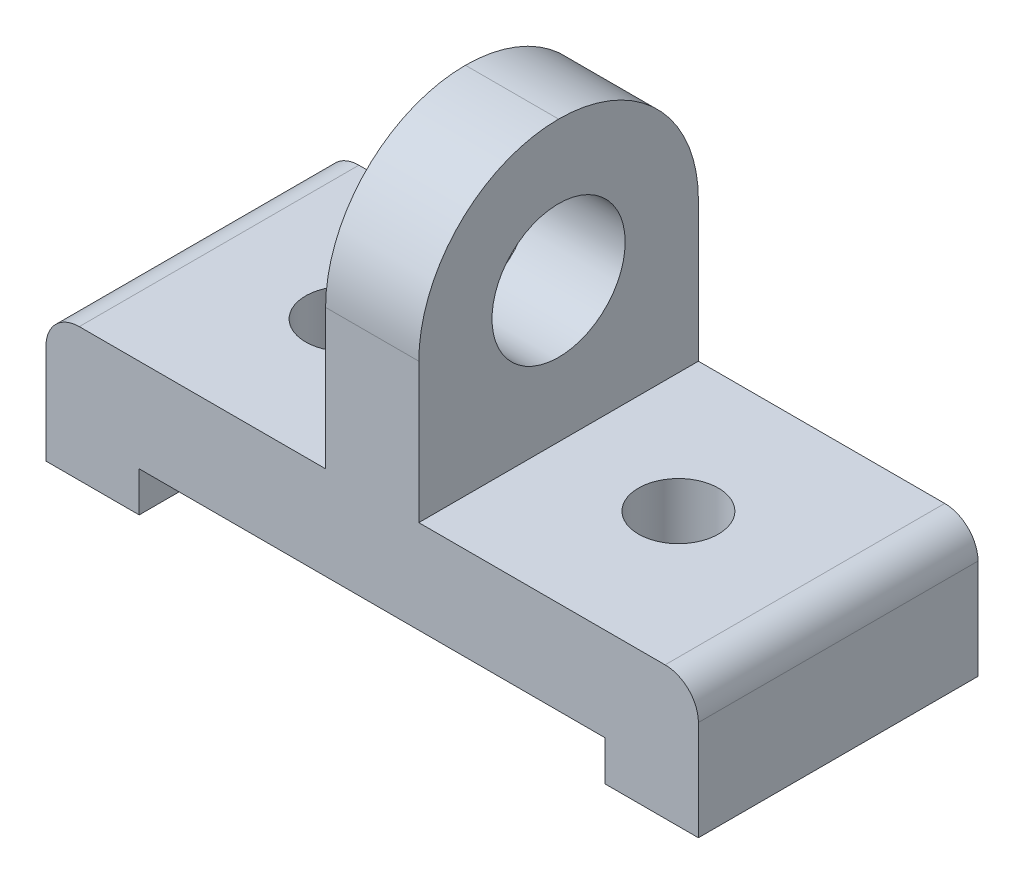
ISO-10303-21;
HEADER;
FILE_DESCRIPTION(('STEP AP214'),'2;1');
FILE_NAME('part.step','',(''),(''),'','','');
FILE_SCHEMA(('AUTOMOTIVE_DESIGN { 1 0 10303 214 1 1 1 1 }'));
ENDSEC;
DATA;
#1=APPLICATION_CONTEXT('core data for automotive mechanical design processes');
#2=APPLICATION_PROTOCOL_DEFINITION('international standard','automotive_design',2000,#1);
#3=PRODUCT_CONTEXT('',#1,'mechanical');
#4=PRODUCT('Part','Part','',(#3));
#5=PRODUCT_RELATED_PRODUCT_CATEGORY('part','',(#4));
#6=PRODUCT_DEFINITION_FORMATION('','',#4);
#7=PRODUCT_DEFINITION_CONTEXT('part definition',#1,'design');
#8=PRODUCT_DEFINITION('design','',#6,#7);
#9=PRODUCT_DEFINITION_SHAPE('','',#8);
#10=(LENGTH_UNIT() NAMED_UNIT(*) SI_UNIT(.MILLI.,.METRE.));
#11=(NAMED_UNIT(*) PLANE_ANGLE_UNIT() SI_UNIT($,.RADIAN.));
#12=(NAMED_UNIT(*) SI_UNIT($,.STERADIAN.) SOLID_ANGLE_UNIT());
#13=UNCERTAINTY_MEASURE_WITH_UNIT(LENGTH_MEASURE(1.E-05),#10,'distance_accuracy_value','');
#14=(GEOMETRIC_REPRESENTATION_CONTEXT(3) GLOBAL_UNCERTAINTY_ASSIGNED_CONTEXT((#13)) GLOBAL_UNIT_ASSIGNED_CONTEXT((#10,
#11,#12)) REPRESENTATION_CONTEXT('',''));
#15=CARTESIAN_POINT('',(0.,0.,0.));
#16=DIRECTION('',(0.,0.,1.));
#17=DIRECTION('',(1.,0.,0.));
#18=AXIS2_PLACEMENT_3D('',#15,#16,#17);
#19=CARTESIAN_POINT('',(-14.,20.,-42.));
#20=DIRECTION('',(0.,1.,0.));
#21=DIRECTION('',(0.,0.,1.));
#22=AXIS2_PLACEMENT_3D('',#19,#20,#21);
#23=PLANE('',#22);
#24=DIRECTION('',(-1.,0.,0.));
#25=VECTOR('',#24,1.);
#26=CARTESIAN_POINT('',(-14.,20.,-42.));
#27=LINE('',#26,#25);
#28=CARTESIAN_POINT('',(28.,20.,-42.));
#29=VERTEX_POINT('',#28);
#30=CARTESIAN_POINT('',(-9.,20.,-42.));
#31=VERTEX_POINT('',#30);
#32=EDGE_CURVE('E153',#29,#31,#27,.T.);
#33=ORIENTED_EDGE('',*,*,#32,.T.);
#34=DIRECTION('',(0.,0.,1.));
#35=VECTOR('',#34,1.);
#36=CARTESIAN_POINT('',(-9.,20.,-42.));
#37=LINE('',#36,#35);
#38=CARTESIAN_POINT('',(-9.,20.,0.));
#39=VERTEX_POINT('',#38);
#40=EDGE_CURVE('E295',#31,#39,#37,.T.);
#41=ORIENTED_EDGE('',*,*,#40,.T.);
#42=DIRECTION('',(-1.,0.,0.));
#43=VECTOR('',#42,1.);
#44=CARTESIAN_POINT('',(-14.,20.,0.));
#45=LINE('',#44,#43);
#46=CARTESIAN_POINT('',(28.,20.,0.));
#47=VERTEX_POINT('',#46);
#48=EDGE_CURVE('E244',#47,#39,#45,.T.);
#49=ORIENTED_EDGE('',*,*,#48,.F.);
#50=DIRECTION('',(0.,0.,1.));
#51=VECTOR('',#50,1.);
#52=CARTESIAN_POINT('',(28.,20.,-42.));
#53=LINE('',#52,#51);
#54=EDGE_CURVE('E172',#29,#47,#53,.T.);
#55=ORIENTED_EDGE('',*,*,#54,.F.);
#56=EDGE_LOOP('',(#33,#41,#49,#55));
#57=FACE_BOUND('',#56,.T.);
#58=CARTESIAN_POINT('',(10.,20.,-21.));
#59=DIRECTION('',(0.,1.,0.));
#60=DIRECTION('',(0.,0.,-1.));
#61=AXIS2_PLACEMENT_3D('',#58,#59,#60);
#62=CIRCLE('',#61,6.);
#63=CARTESIAN_POINT('',(10.,20.,-15.));
#64=VERTEX_POINT('',#63);
#65=EDGE_CURVE('E187',#64,#64,#62,.T.);
#66=ORIENTED_EDGE('',*,*,#65,.F.);
#67=EDGE_LOOP('',(#66));
#68=FACE_BOUND('',#67,.T.);
#69=ADVANCED_FACE('F39',(#57,#68),#23,.T.);
#70=CARTESIAN_POINT('',(0.,6.,-42.));
#71=DIRECTION('',(1.,0.,0.));
#72=DIRECTION('',(0.,1.,0.));
#73=AXIS2_PLACEMENT_3D('',#70,#71,#72);
#74=PLANE('',#73);
#75=DIRECTION('',(0.,1.,0.));
#76=VECTOR('',#75,1.);
#77=CARTESIAN_POINT('',(0.,6.,0.));
#78=LINE('',#77,#76);
#79=CARTESIAN_POINT('',(0.,0.,0.));
#80=VERTEX_POINT('',#79);
#81=CARTESIAN_POINT('',(0.,6.,0.));
#82=VERTEX_POINT('',#81);
#83=EDGE_CURVE('E223',#80,#82,#78,.T.);
#84=ORIENTED_EDGE('',*,*,#83,.F.);
#85=DIRECTION('',(0.,0.,1.));
#86=VECTOR('',#85,1.);
#87=CARTESIAN_POINT('',(0.,0.,-42.));
#88=LINE('',#87,#86);
#89=CARTESIAN_POINT('',(0.,0.,-42.));
#90=VERTEX_POINT('',#89);
#91=EDGE_CURVE('E254',#90,#80,#88,.T.);
#92=ORIENTED_EDGE('',*,*,#91,.F.);
#93=DIRECTION('',(0.,1.,0.));
#94=VECTOR('',#93,1.);
#95=CARTESIAN_POINT('',(0.,6.,-42.));
#96=LINE('',#95,#94);
#97=CARTESIAN_POINT('',(0.,6.,-42.));
#98=VERTEX_POINT('',#97);
#99=EDGE_CURVE('E196',#90,#98,#96,.T.);
#100=ORIENTED_EDGE('',*,*,#99,.T.);
#101=DIRECTION('',(0.,0.,1.));
#102=VECTOR('',#101,1.);
#103=CARTESIAN_POINT('',(0.,6.,-42.));
#104=LINE('',#103,#102);
#105=EDGE_CURVE('E222',#98,#82,#104,.T.);
#106=ORIENTED_EDGE('',*,*,#105,.T.);
#107=EDGE_LOOP('',(#84,#92,#100,#106));
#108=FACE_BOUND('',#107,.T.);
#109=ADVANCED_FACE('F342',(#108),#74,.T.);
#110=CARTESIAN_POINT('',(0.,0.,-42.));
#111=DIRECTION('',(0.,-1.,0.));
#112=DIRECTION('',(1.,0.,0.));
#113=AXIS2_PLACEMENT_3D('',#110,#111,#112);
#114=PLANE('',#113);
#115=DIRECTION('',(1.,0.,0.));
#116=VECTOR('',#115,1.);
#117=CARTESIAN_POINT('',(0.,0.,0.));
#118=LINE('',#117,#116);
#119=CARTESIAN_POINT('',(-14.,0.,0.));
#120=VERTEX_POINT('',#119);
#121=EDGE_CURVE('E201',#120,#80,#118,.T.);
#122=ORIENTED_EDGE('',*,*,#121,.F.);
#123=DIRECTION('',(0.,0.,1.));
#124=VECTOR('',#123,1.);
#125=CARTESIAN_POINT('',(-14.,0.,-42.));
#126=LINE('',#125,#124);
#127=CARTESIAN_POINT('',(-14.,0.,-42.));
#128=VERTEX_POINT('',#127);
#129=EDGE_CURVE('E258',#128,#120,#126,.T.);
#130=ORIENTED_EDGE('',*,*,#129,.F.);
#131=DIRECTION('',(1.,0.,0.));
#132=VECTOR('',#131,1.);
#133=CARTESIAN_POINT('',(0.,0.,-42.));
#134=LINE('',#133,#132);
#135=EDGE_CURVE('E218',#128,#90,#134,.T.);
#136=ORIENTED_EDGE('',*,*,#135,.T.);
#137=ORIENTED_EDGE('',*,*,#91,.T.);
#138=EDGE_LOOP('',(#122,#130,#136,#137));
#139=FACE_BOUND('',#138,.T.);
#140=ADVANCED_FACE('F345',(#139),#114,.T.);
#141=CARTESIAN_POINT('',(-14.,0.,-42.));
#142=DIRECTION('',(-1.,0.,0.));
#143=DIRECTION('',(0.,0.,1.));
#144=AXIS2_PLACEMENT_3D('',#141,#142,#143);
#145=PLANE('',#144);
#146=DIRECTION('',(0.,-1.,0.));
#147=VECTOR('',#146,1.);
#148=CARTESIAN_POINT('',(-14.,0.,0.));
#149=LINE('',#148,#147);
#150=CARTESIAN_POINT('',(-14.,15.,0.));
#151=VERTEX_POINT('',#150);
#152=EDGE_CURVE('E248',#151,#120,#149,.T.);
#153=ORIENTED_EDGE('',*,*,#152,.F.);
#154=DIRECTION('',(0.,0.,1.));
#155=VECTOR('',#154,1.);
#156=CARTESIAN_POINT('',(-14.,15.,-42.));
#157=LINE('',#156,#155);
#158=CARTESIAN_POINT('',(-14.,15.,-42.));
#159=VERTEX_POINT('',#158);
#160=EDGE_CURVE('E309',#151,#159,#157,.F.);
#161=ORIENTED_EDGE('',*,*,#160,.T.);
#162=DIRECTION('',(0.,-1.,0.));
#163=VECTOR('',#162,1.);
#164=CARTESIAN_POINT('',(-14.,0.,-42.));
#165=LINE('',#164,#163);
#166=EDGE_CURVE('E152',#159,#128,#165,.T.);
#167=ORIENTED_EDGE('',*,*,#166,.T.);
#168=ORIENTED_EDGE('',*,*,#129,.T.);
#169=EDGE_LOOP('',(#153,#161,#167,#168));
#170=FACE_BOUND('',#169,.T.);
#171=ADVANCED_FACE('F388',(#170),#145,.T.);
#172=CARTESIAN_POINT('',(79.,20.,0.));
#173=VERTEX_POINT('',#172);
#174=CARTESIAN_POINT('',(42.,20.,0.));
#175=VERTEX_POINT('',#174);
#176=EDGE_CURVE('E245',#173,#175,#45,.T.);
#177=ORIENTED_EDGE('',*,*,#176,.F.);
#178=DIRECTION('',(0.,0.,1.));
#179=VECTOR('',#178,1.);
#180=CARTESIAN_POINT('',(79.,20.,-42.));
#181=LINE('',#180,#179);
#182=CARTESIAN_POINT('',(79.,20.,-42.));
#183=VERTEX_POINT('',#182);
#184=EDGE_CURVE('E11',#173,#183,#181,.F.);
#185=ORIENTED_EDGE('',*,*,#184,.T.);
#186=CARTESIAN_POINT('',(42.,20.,-42.));
#187=VERTEX_POINT('',#186);
#188=EDGE_CURVE('E145',#183,#187,#27,.T.);
#189=ORIENTED_EDGE('',*,*,#188,.T.);
#190=DIRECTION('',(0.,0.,-1.));
#191=VECTOR('',#190,1.);
#192=CARTESIAN_POINT('',(42.,20.,-42.));
#193=LINE('',#192,#191);
#194=EDGE_CURVE('E150',#175,#187,#193,.T.);
#195=ORIENTED_EDGE('',*,*,#194,.F.);
#196=EDGE_LOOP('',(#177,#185,#189,#195));
#197=FACE_BOUND('',#196,.T.);
#198=CARTESIAN_POINT('',(60.,20.,-21.));
#199=DIRECTION('',(0.,1.,0.));
#200=DIRECTION('',(0.,0.,1.));
#201=AXIS2_PLACEMENT_3D('',#198,#199,#200);
#202=CIRCLE('',#201,6.);
#203=CARTESIAN_POINT('',(60.,20.,-15.));
#204=VERTEX_POINT('',#203);
#205=EDGE_CURVE('E188',#204,#204,#202,.T.);
#206=ORIENTED_EDGE('',*,*,#205,.F.);
#207=EDGE_LOOP('',(#206));
#208=FACE_BOUND('',#207,.T.);
#209=ADVANCED_FACE('F147',(#197,#208),#23,.T.);
#210=CARTESIAN_POINT('',(84.,20.,-42.));
#211=DIRECTION('',(1.,0.,0.));
#212=DIRECTION('',(0.,1.,0.));
#213=AXIS2_PLACEMENT_3D('',#210,#211,#212);
#214=PLANE('',#213);
#215=DIRECTION('',(0.,1.,0.));
#216=VECTOR('',#215,1.);
#217=CARTESIAN_POINT('',(84.,20.,-42.));
#218=LINE('',#217,#216);
#219=CARTESIAN_POINT('',(84.,0.,-42.));
#220=VERTEX_POINT('',#219);
#221=CARTESIAN_POINT('',(84.,15.,-42.));
#222=VERTEX_POINT('',#221);
#223=EDGE_CURVE('E213',#220,#222,#218,.T.);
#224=ORIENTED_EDGE('',*,*,#223,.T.);
#225=DIRECTION('',(0.,0.,1.));
#226=VECTOR('',#225,1.);
#227=CARTESIAN_POINT('',(84.,15.,-42.));
#228=LINE('',#227,#226);
#229=CARTESIAN_POINT('',(84.,15.,0.));
#230=VERTEX_POINT('',#229);
#231=EDGE_CURVE('E48',#222,#230,#228,.T.);
#232=ORIENTED_EDGE('',*,*,#231,.T.);
#233=DIRECTION('',(0.,1.,0.));
#234=VECTOR('',#233,1.);
#235=CARTESIAN_POINT('',(84.,20.,0.));
#236=LINE('',#235,#234);
#237=CARTESIAN_POINT('',(84.,0.,0.));
#238=VERTEX_POINT('',#237);
#239=EDGE_CURVE('E240',#238,#230,#236,.T.);
#240=ORIENTED_EDGE('',*,*,#239,.F.);
#241=DIRECTION('',(0.,0.,1.));
#242=VECTOR('',#241,1.);
#243=CARTESIAN_POINT('',(84.,0.,-42.));
#244=LINE('',#243,#242);
#245=EDGE_CURVE('E262',#220,#238,#244,.T.);
#246=ORIENTED_EDGE('',*,*,#245,.F.);
#247=EDGE_LOOP('',(#224,#232,#240,#246));
#248=FACE_BOUND('',#247,.T.);
#249=ADVANCED_FACE('F321',(#248),#214,.T.);
#250=CARTESIAN_POINT('',(84.,0.,-42.));
#251=DIRECTION('',(0.,-1.,0.));
#252=DIRECTION('',(1.,0.,0.));
#253=AXIS2_PLACEMENT_3D('',#250,#251,#252);
#254=PLANE('',#253);
#255=DIRECTION('',(1.,0.,0.));
#256=VECTOR('',#255,1.);
#257=CARTESIAN_POINT('',(84.,0.,0.));
#258=LINE('',#257,#256);
#259=CARTESIAN_POINT('',(70.,0.,0.));
#260=VERTEX_POINT('',#259);
#261=EDGE_CURVE('E236',#260,#238,#258,.T.);
#262=ORIENTED_EDGE('',*,*,#261,.F.);
#263=DIRECTION('',(0.,0.,1.));
#264=VECTOR('',#263,1.);
#265=CARTESIAN_POINT('',(70.,0.,-42.));
#266=LINE('',#265,#264);
#267=CARTESIAN_POINT('',(70.,0.,-42.));
#268=VERTEX_POINT('',#267);
#269=EDGE_CURVE('E265',#268,#260,#266,.T.);
#270=ORIENTED_EDGE('',*,*,#269,.F.);
#271=DIRECTION('',(1.,0.,0.));
#272=VECTOR('',#271,1.);
#273=CARTESIAN_POINT('',(84.,0.,-42.));
#274=LINE('',#273,#272);
#275=EDGE_CURVE('E209',#268,#220,#274,.T.);
#276=ORIENTED_EDGE('',*,*,#275,.T.);
#277=ORIENTED_EDGE('',*,*,#245,.T.);
#278=EDGE_LOOP('',(#262,#270,#276,#277));
#279=FACE_BOUND('',#278,.T.);
#280=ADVANCED_FACE('F329',(#279),#254,.T.);
#281=CARTESIAN_POINT('',(70.,0.,-42.));
#282=DIRECTION('',(-1.,0.,0.));
#283=DIRECTION('',(0.,0.,1.));
#284=AXIS2_PLACEMENT_3D('',#281,#282,#283);
#285=PLANE('',#284);
#286=DIRECTION('',(0.,-1.,0.));
#287=VECTOR('',#286,1.);
#288=CARTESIAN_POINT('',(70.,0.,0.));
#289=LINE('',#288,#287);
#290=CARTESIAN_POINT('',(70.,6.00000000000001,0.));
#291=VERTEX_POINT('',#290);
#292=EDGE_CURVE('E232',#291,#260,#289,.T.);
#293=ORIENTED_EDGE('',*,*,#292,.F.);
#294=DIRECTION('',(0.,0.,1.));
#295=VECTOR('',#294,1.);
#296=CARTESIAN_POINT('',(70.,6.00000000000001,-42.));
#297=LINE('',#296,#295);
#298=CARTESIAN_POINT('',(70.,6.00000000000001,-42.));
#299=VERTEX_POINT('',#298);
#300=EDGE_CURVE('E268',#299,#291,#297,.T.);
#301=ORIENTED_EDGE('',*,*,#300,.F.);
#302=DIRECTION('',(0.,-1.,0.));
#303=VECTOR('',#302,1.);
#304=CARTESIAN_POINT('',(70.,0.,-42.));
#305=LINE('',#304,#303);
#306=EDGE_CURVE('E205',#299,#268,#305,.T.);
#307=ORIENTED_EDGE('',*,*,#306,.T.);
#308=ORIENTED_EDGE('',*,*,#269,.T.);
#309=EDGE_LOOP('',(#293,#301,#307,#308));
#310=FACE_BOUND('',#309,.T.);
#311=ADVANCED_FACE('F334',(#310),#285,.T.);
#312=CARTESIAN_POINT('',(70.,6.00000000000001,-42.));
#313=DIRECTION('',(0.,-1.,0.));
#314=DIRECTION('',(1.,0.,0.));
#315=AXIS2_PLACEMENT_3D('',#312,#313,#314);
#316=PLANE('',#315);
#317=CARTESIAN_POINT('',(60.,6.00000000000001,-21.));
#318=DIRECTION('',(0.,-1.,0.));
#319=DIRECTION('',(1.,0.,0.));
#320=AXIS2_PLACEMENT_3D('',#317,#318,#319);
#321=CIRCLE('',#320,6.);
#322=CARTESIAN_POINT('',(60.,6.00000000000001,-15.));
#323=VERTEX_POINT('',#322);
#324=EDGE_CURVE('E228',#323,#323,#321,.T.);
#325=ORIENTED_EDGE('',*,*,#324,.F.);
#326=EDGE_LOOP('',(#325));
#327=FACE_BOUND('',#326,.T.);
#328=CARTESIAN_POINT('',(10.,6.,-21.));
#329=DIRECTION('',(0.,-1.,0.));
#330=DIRECTION('',(1.,0.,0.));
#331=AXIS2_PLACEMENT_3D('',#328,#329,#330);
#332=CIRCLE('',#331,6.);
#333=CARTESIAN_POINT('',(10.,6.00000000000001,-15.));
#334=VERTEX_POINT('',#333);
#335=EDGE_CURVE('E192',#334,#334,#332,.T.);
#336=ORIENTED_EDGE('',*,*,#335,.F.);
#337=EDGE_LOOP('',(#336));
#338=FACE_BOUND('',#337,.T.);
#339=DIRECTION('',(1.,0.,0.));
#340=VECTOR('',#339,1.);
#341=CARTESIAN_POINT('',(70.,6.00000000000001,0.));
#342=LINE('',#341,#340);
#343=EDGE_CURVE('E227',#82,#291,#342,.T.);
#344=ORIENTED_EDGE('',*,*,#343,.F.);
#345=ORIENTED_EDGE('',*,*,#105,.F.);
#346=DIRECTION('',(1.,0.,0.));
#347=VECTOR('',#346,1.);
#348=CARTESIAN_POINT('',(70.,6.00000000000001,-42.));
#349=LINE('',#348,#347);
#350=EDGE_CURVE('E200',#98,#299,#349,.T.);
#351=ORIENTED_EDGE('',*,*,#350,.T.);
#352=ORIENTED_EDGE('',*,*,#300,.T.);
#353=EDGE_LOOP('',(#344,#345,#351,#352));
#354=FACE_BOUND('',#353,.T.);
#355=ADVANCED_FACE('F337',(#327,#338,#354),#316,.T.);
#356=CARTESIAN_POINT('',(0.,0.,-42.));
#357=DIRECTION('',(0.,0.,-1.));
#358=DIRECTION('',(-1.,0.,0.));
#359=AXIS2_PLACEMENT_3D('',#356,#357,#358);
#360=PLANE('',#359);
#361=ORIENTED_EDGE('',*,*,#166,.F.);
#362=CARTESIAN_POINT('',(-9.,15.,-42.));
#363=DIRECTION('',(0.,0.,-1.));
#364=DIRECTION('',(-1.,0.,0.));
#365=AXIS2_PLACEMENT_3D('',#362,#363,#364);
#366=CIRCLE('',#365,5.);
#367=EDGE_CURVE('E314',#159,#31,#366,.T.);
#368=ORIENTED_EDGE('',*,*,#367,.T.);
#369=ORIENTED_EDGE('',*,*,#32,.F.);
#370=DIRECTION('',(0.,-1.,0.));
#371=VECTOR('',#370,1.);
#372=CARTESIAN_POINT('',(28.,62.,-42.));
#373=LINE('',#372,#371);
#374=CARTESIAN_POINT('',(28.,41.,-42.));
#375=VERTEX_POINT('',#374);
#376=EDGE_CURVE('E166',#375,#29,#373,.T.);
#377=ORIENTED_EDGE('',*,*,#376,.F.);
#378=DIRECTION('',(-1.,0.,0.));
#379=VECTOR('',#378,1.);
#380=CARTESIAN_POINT('',(0.,41.,-42.));
#381=LINE('',#380,#379);
#382=CARTESIAN_POINT('',(42.,41.,-42.));
#383=VERTEX_POINT('',#382);
#384=EDGE_CURVE('E162',#375,#383,#381,.F.);
#385=ORIENTED_EDGE('',*,*,#384,.T.);
#386=DIRECTION('',(0.,-1.,0.));
#387=VECTOR('',#386,1.);
#388=CARTESIAN_POINT('',(42.,62.,-42.));
#389=LINE('',#388,#387);
#390=EDGE_CURVE('E157',#383,#187,#389,.T.);
#391=ORIENTED_EDGE('',*,*,#390,.T.);
#392=ORIENTED_EDGE('',*,*,#188,.F.);
#393=CARTESIAN_POINT('',(79.,15.,-42.));
#394=DIRECTION('',(0.,0.,-1.));
#395=DIRECTION('',(-1.,0.,0.));
#396=AXIS2_PLACEMENT_3D('',#393,#394,#395);
#397=CIRCLE('',#396,5.);
#398=EDGE_CURVE('E55',#183,#222,#397,.T.);
#399=ORIENTED_EDGE('',*,*,#398,.T.);
#400=ORIENTED_EDGE('',*,*,#223,.F.);
#401=ORIENTED_EDGE('',*,*,#275,.F.);
#402=ORIENTED_EDGE('',*,*,#306,.F.);
#403=ORIENTED_EDGE('',*,*,#350,.F.);
#404=ORIENTED_EDGE('',*,*,#99,.F.);
#405=ORIENTED_EDGE('',*,*,#135,.F.);
#406=EDGE_LOOP('',(#361,#368,#369,#377,#385,#391,#392,#399,#400,#401,#402,#403,#404,#405));
#407=FACE_BOUND('',#406,.T.);
#408=ADVANCED_FACE('F159',(#407),#360,.T.);
#409=CARTESIAN_POINT('',(0.,0.,0.));
#410=DIRECTION('',(0.,0.,-1.));
#411=DIRECTION('',(-1.,0.,0.));
#412=AXIS2_PLACEMENT_3D('',#409,#410,#411);
#413=PLANE('',#412);
#414=ORIENTED_EDGE('',*,*,#48,.T.);
#415=CARTESIAN_POINT('',(-9.,15.,0.));
#416=DIRECTION('',(0.,0.,-1.));
#417=DIRECTION('',(-1.,0.,0.));
#418=AXIS2_PLACEMENT_3D('',#415,#416,#417);
#419=CIRCLE('',#418,5.);
#420=EDGE_CURVE('E306',#39,#151,#419,.F.);
#421=ORIENTED_EDGE('',*,*,#420,.T.);
#422=ORIENTED_EDGE('',*,*,#152,.T.);
#423=ORIENTED_EDGE('',*,*,#121,.T.);
#424=ORIENTED_EDGE('',*,*,#83,.T.);
#425=ORIENTED_EDGE('',*,*,#343,.T.);
#426=ORIENTED_EDGE('',*,*,#292,.T.);
#427=ORIENTED_EDGE('',*,*,#261,.T.);
#428=ORIENTED_EDGE('',*,*,#239,.T.);
#429=CARTESIAN_POINT('',(79.,15.,0.));
#430=DIRECTION('',(0.,0.,-1.));
#431=DIRECTION('',(-1.,0.,0.));
#432=AXIS2_PLACEMENT_3D('',#429,#430,#431);
#433=CIRCLE('',#432,5.);
#434=EDGE_CURVE('E303',#230,#173,#433,.F.);
#435=ORIENTED_EDGE('',*,*,#434,.T.);
#436=ORIENTED_EDGE('',*,*,#176,.T.);
#437=DIRECTION('',(0.,-1.,0.));
#438=VECTOR('',#437,1.);
#439=CARTESIAN_POINT('',(42.,62.,0.));
#440=LINE('',#439,#438);
#441=CARTESIAN_POINT('',(42.,41.,0.));
#442=VERTEX_POINT('',#441);
#443=EDGE_CURVE('E165',#442,#175,#440,.T.);
#444=ORIENTED_EDGE('',*,*,#443,.F.);
#445=DIRECTION('',(1.,0.,0.));
#446=VECTOR('',#445,1.);
#447=CARTESIAN_POINT('',(28.,41.,0.));
#448=LINE('',#447,#446);
#449=CARTESIAN_POINT('',(28.,41.,0.));
#450=VERTEX_POINT('',#449);
#451=EDGE_CURVE('E292',#442,#450,#448,.F.);
#452=ORIENTED_EDGE('',*,*,#451,.T.);
#453=DIRECTION('',(0.,-1.,0.));
#454=VECTOR('',#453,1.);
#455=CARTESIAN_POINT('',(28.,62.,0.));
#456=LINE('',#455,#454);
#457=EDGE_CURVE('E184',#450,#47,#456,.T.);
#458=ORIENTED_EDGE('',*,*,#457,.T.);
#459=EDGE_LOOP('',(#414,#421,#422,#423,#424,#425,#426,#427,#428,#435,#436,#444,#452,#458));
#460=FACE_BOUND('',#459,.T.);
#461=ADVANCED_FACE('F325',(#460),#413,.F.);
#462=CARTESIAN_POINT('',(10.,-22.,-21.));
#463=DIRECTION('',(0.,1.,0.));
#464=DIRECTION('',(0.,0.,1.));
#465=AXIS2_PLACEMENT_3D('',#462,#463,#464);
#466=CYLINDRICAL_SURFACE('',#465,6.);
#467=CARTESIAN_POINT('',(10.,6.00000000000001,-15.));
#468=CARTESIAN_POINT('',(10.,6.14583333333334,-15.));
#469=CARTESIAN_POINT('',(10.,6.29166666666667,-15.));
#470=CARTESIAN_POINT('',(10.,6.58333333333334,-15.));
#471=CARTESIAN_POINT('',(10.,6.72916666666667,-15.));
#472=CARTESIAN_POINT('',(10.,7.02083333333334,-15.));
#473=CARTESIAN_POINT('',(10.,7.16666666666667,-15.));
#474=CARTESIAN_POINT('',(10.,7.45833333333334,-15.));
#475=CARTESIAN_POINT('',(10.,7.60416666666667,-15.));
#476=CARTESIAN_POINT('',(10.,7.89583333333334,-15.));
#477=CARTESIAN_POINT('',(10.,8.04166666666667,-15.));
#478=CARTESIAN_POINT('',(10.,8.33333333333334,-15.));
#479=CARTESIAN_POINT('',(10.,8.47916666666667,-15.));
#480=CARTESIAN_POINT('',(10.,8.77083333333334,-15.));
#481=CARTESIAN_POINT('',(10.,8.91666666666667,-15.));
#482=CARTESIAN_POINT('',(10.,9.20833333333334,-15.));
#483=CARTESIAN_POINT('',(10.,9.35416666666667,-15.));
#484=CARTESIAN_POINT('',(10.,9.64583333333334,-15.));
#485=CARTESIAN_POINT('',(10.,9.79166666666667,-15.));
#486=CARTESIAN_POINT('',(10.,10.0833333333333,-15.));
#487=CARTESIAN_POINT('',(10.,10.2291666666667,-15.));
#488=CARTESIAN_POINT('',(10.,10.5208333333333,-15.));
#489=CARTESIAN_POINT('',(10.,10.6666666666667,-15.));
#490=CARTESIAN_POINT('',(10.,10.9583333333333,-15.));
#491=CARTESIAN_POINT('',(10.,11.1041666666667,-15.));
#492=CARTESIAN_POINT('',(10.,11.3958333333333,-15.));
#493=CARTESIAN_POINT('',(10.,11.5416666666667,-15.));
#494=CARTESIAN_POINT('',(10.,11.8333333333333,-15.));
#495=CARTESIAN_POINT('',(10.,11.9791666666667,-15.));
#496=CARTESIAN_POINT('',(10.,12.2708333333333,-15.));
#497=CARTESIAN_POINT('',(10.,12.4166666666667,-15.));
#498=CARTESIAN_POINT('',(10.,12.7083333333333,-15.));
#499=CARTESIAN_POINT('',(10.,12.8541666666667,-15.));
#500=CARTESIAN_POINT('',(10.,13.1458333333333,-15.));
#501=CARTESIAN_POINT('',(10.,13.2916666666667,-15.));
#502=CARTESIAN_POINT('',(10.,13.5833333333333,-15.));
#503=CARTESIAN_POINT('',(10.,13.7291666666667,-15.));
#504=CARTESIAN_POINT('',(10.,14.0208333333333,-15.));
#505=CARTESIAN_POINT('',(10.,14.1666666666667,-15.));
#506=CARTESIAN_POINT('',(10.,14.4583333333333,-15.));
#507=CARTESIAN_POINT('',(10.,14.6041666666667,-15.));
#508=CARTESIAN_POINT('',(10.,14.8958333333333,-15.));
#509=CARTESIAN_POINT('',(10.,15.0416666666667,-15.));
#510=CARTESIAN_POINT('',(10.,15.3333333333333,-15.));
#511=CARTESIAN_POINT('',(10.,15.4791666666667,-15.));
#512=CARTESIAN_POINT('',(10.,15.7708333333333,-15.));
#513=CARTESIAN_POINT('',(10.,15.9166666666667,-15.));
#514=CARTESIAN_POINT('',(10.,16.2083333333333,-15.));
#515=CARTESIAN_POINT('',(10.,16.3541666666667,-15.));
#516=CARTESIAN_POINT('',(10.,16.6458333333333,-15.));
#517=CARTESIAN_POINT('',(10.,16.7916666666667,-15.));
#518=CARTESIAN_POINT('',(10.,17.0833333333333,-15.));
#519=CARTESIAN_POINT('',(10.,17.2291666666667,-15.));
#520=CARTESIAN_POINT('',(10.,17.5208333333333,-15.));
#521=CARTESIAN_POINT('',(10.,17.6666666666667,-15.));
#522=CARTESIAN_POINT('',(10.,17.9583333333333,-15.));
#523=CARTESIAN_POINT('',(10.,18.1041666666667,-15.));
#524=CARTESIAN_POINT('',(10.,18.3958333333333,-15.));
#525=CARTESIAN_POINT('',(10.,18.5416666666667,-15.));
#526=CARTESIAN_POINT('',(10.,18.8333333333333,-15.));
#527=CARTESIAN_POINT('',(10.,18.9791666666667,-15.));
#528=CARTESIAN_POINT('',(10.,19.2708333333333,-15.));
#529=CARTESIAN_POINT('',(10.,19.4166666666667,-15.));
#530=CARTESIAN_POINT('',(10.,19.7083333333333,-15.));
#531=CARTESIAN_POINT('',(10.,19.8541666666667,-15.));
#532=CARTESIAN_POINT('',(10.,20.,-15.));
#533=B_SPLINE_CURVE_WITH_KNOTS('',3,(#467,#468,#469,#470,#471,#472,#473,#474,#475,#476,#477,
#478,#479,#480,#481,#482,#483,#484,#485,#486,#487,#488,#489,#490,#491,#492,#493,#494,#495,#496,
#497,#498,#499,#500,#501,#502,#503,#504,#505,#506,#507,#508,#509,#510,#511,#512,#513,#514,#515,
#516,#517,#518,#519,#520,#521,#522,#523,#524,#525,#526,#527,#528,#529,#530,#531,#532),
.UNSPECIFIED.,.F.,.F.,(4,2,2,2,2,2,2,2,2,2,2,2,2,2,2,2,2,2,2,2,2,2,2,2,2,2,2,2,2,2,2,2,4),(0.,
0.4375,0.875000000000001,1.3125,1.75,2.1875,2.625,3.0625,3.5,3.93749999999999,4.37499999999999,
4.81249999999999,5.24999999999999,5.68749999999999,6.12499999999999,6.5625,7.,7.4375,7.875,
8.3125,8.75,9.1875,9.62499999999999,10.0625,10.5,10.9375,11.375,11.8125,12.25,12.6875,13.125,
13.5625,14.),.UNSPECIFIED.);
#534=EDGE_CURVE('BSEAM400',#334,#64,#533,.T.);
#535=ORIENTED_EDGE('',*,*,#335,.T.);
#536=ORIENTED_EDGE('',*,*,#65,.T.);
#537=ORIENTED_EDGE('',*,*,#534,.T.);
#538=ORIENTED_EDGE('',*,*,#534,.F.);
#539=EDGE_LOOP('',(#535,#537,#536,#538));
#540=FACE_BOUND('',#539,.T.);
#541=ADVANCED_FACE('F400',(#540),#466,.F.);
#542=CARTESIAN_POINT('',(60.,-22.,-21.));
#543=DIRECTION('',(0.,1.,0.));
#544=DIRECTION('',(0.,0.,1.));
#545=AXIS2_PLACEMENT_3D('',#542,#543,#544);
#546=CYLINDRICAL_SURFACE('',#545,6.);
#547=CARTESIAN_POINT('',(60.,6.00000000000001,-15.));
#548=CARTESIAN_POINT('',(60.,6.14583333333335,-15.));
#549=CARTESIAN_POINT('',(60.,6.29166666666668,-15.));
#550=CARTESIAN_POINT('',(60.,6.58333333333335,-15.));
#551=CARTESIAN_POINT('',(60.,6.72916666666668,-15.));
#552=CARTESIAN_POINT('',(60.,7.02083333333335,-15.));
#553=CARTESIAN_POINT('',(60.,7.16666666666668,-15.));
#554=CARTESIAN_POINT('',(60.,7.45833333333334,-15.));
#555=CARTESIAN_POINT('',(60.,7.60416666666668,-15.));
#556=CARTESIAN_POINT('',(60.,7.89583333333334,-15.));
#557=CARTESIAN_POINT('',(60.,8.04166666666668,-15.));
#558=CARTESIAN_POINT('',(60.,8.33333333333334,-15.));
#559=CARTESIAN_POINT('',(60.,8.47916666666668,-15.));
#560=CARTESIAN_POINT('',(60.,8.77083333333334,-15.));
#561=CARTESIAN_POINT('',(60.,8.91666666666668,-15.));
#562=CARTESIAN_POINT('',(60.,9.20833333333334,-15.));
#563=CARTESIAN_POINT('',(60.,9.35416666666667,-15.));
#564=CARTESIAN_POINT('',(60.,9.64583333333334,-15.));
#565=CARTESIAN_POINT('',(60.,9.79166666666667,-15.));
#566=CARTESIAN_POINT('',(60.,10.0833333333333,-15.));
#567=CARTESIAN_POINT('',(60.,10.2291666666667,-15.));
#568=CARTESIAN_POINT('',(60.,10.5208333333333,-15.));
#569=CARTESIAN_POINT('',(60.,10.6666666666667,-15.));
#570=CARTESIAN_POINT('',(60.,10.9583333333333,-15.));
#571=CARTESIAN_POINT('',(60.,11.1041666666667,-15.));
#572=CARTESIAN_POINT('',(60.,11.3958333333333,-15.));
#573=CARTESIAN_POINT('',(60.,11.5416666666667,-15.));
#574=CARTESIAN_POINT('',(60.,11.8333333333333,-15.));
#575=CARTESIAN_POINT('',(60.,11.9791666666667,-15.));
#576=CARTESIAN_POINT('',(60.,12.2708333333333,-15.));
#577=CARTESIAN_POINT('',(60.,12.4166666666667,-15.));
#578=CARTESIAN_POINT('',(60.,12.7083333333333,-15.));
#579=CARTESIAN_POINT('',(60.,12.8541666666667,-15.));
#580=CARTESIAN_POINT('',(60.,13.1458333333333,-15.));
#581=CARTESIAN_POINT('',(60.,13.2916666666667,-15.));
#582=CARTESIAN_POINT('',(60.,13.5833333333333,-15.));
#583=CARTESIAN_POINT('',(60.,13.7291666666667,-15.));
#584=CARTESIAN_POINT('',(60.,14.0208333333333,-15.));
#585=CARTESIAN_POINT('',(60.,14.1666666666667,-15.));
#586=CARTESIAN_POINT('',(60.,14.4583333333333,-15.));
#587=CARTESIAN_POINT('',(60.,14.6041666666667,-15.));
#588=CARTESIAN_POINT('',(60.,14.8958333333333,-15.));
#589=CARTESIAN_POINT('',(60.,15.0416666666667,-15.));
#590=CARTESIAN_POINT('',(60.,15.3333333333333,-15.));
#591=CARTESIAN_POINT('',(60.,15.4791666666667,-15.));
#592=CARTESIAN_POINT('',(60.,15.7708333333333,-15.));
#593=CARTESIAN_POINT('',(60.,15.9166666666667,-15.));
#594=CARTESIAN_POINT('',(60.,16.2083333333333,-15.));
#595=CARTESIAN_POINT('',(60.,16.3541666666667,-15.));
#596=CARTESIAN_POINT('',(60.,16.6458333333333,-15.));
#597=CARTESIAN_POINT('',(60.,16.7916666666667,-15.));
#598=CARTESIAN_POINT('',(60.,17.0833333333333,-15.));
#599=CARTESIAN_POINT('',(60.,17.2291666666667,-15.));
#600=CARTESIAN_POINT('',(60.,17.5208333333333,-15.));
#601=CARTESIAN_POINT('',(60.,17.6666666666667,-15.));
#602=CARTESIAN_POINT('',(60.,17.9583333333333,-15.));
#603=CARTESIAN_POINT('',(60.,18.1041666666667,-15.));
#604=CARTESIAN_POINT('',(60.,18.3958333333333,-15.));
#605=CARTESIAN_POINT('',(60.,18.5416666666667,-15.));
#606=CARTESIAN_POINT('',(60.,18.8333333333333,-15.));
#607=CARTESIAN_POINT('',(60.,18.9791666666667,-15.));
#608=CARTESIAN_POINT('',(60.,19.2708333333333,-15.));
#609=CARTESIAN_POINT('',(60.,19.4166666666667,-15.));
#610=CARTESIAN_POINT('',(60.,19.7083333333333,-15.));
#611=CARTESIAN_POINT('',(60.,19.8541666666667,-15.));
#612=CARTESIAN_POINT('',(60.,20.,-15.));
#613=B_SPLINE_CURVE_WITH_KNOTS('',3,(#547,#548,#549,#550,#551,#552,#553,#554,#555,#556,#557,
#558,#559,#560,#561,#562,#563,#564,#565,#566,#567,#568,#569,#570,#571,#572,#573,#574,#575,#576,
#577,#578,#579,#580,#581,#582,#583,#584,#585,#586,#587,#588,#589,#590,#591,#592,#593,#594,#595,
#596,#597,#598,#599,#600,#601,#602,#603,#604,#605,#606,#607,#608,#609,#610,#611,#612),
.UNSPECIFIED.,.F.,.F.,(4,2,2,2,2,2,2,2,2,2,2,2,2,2,2,2,2,2,2,2,2,2,2,2,2,2,2,2,2,2,2,2,4),(0.,
0.4375,0.875000000000001,1.3125,1.75,2.1875,2.625,3.0625,3.49999999999999,3.93749999999999,
4.37499999999999,4.81249999999999,5.24999999999999,5.68749999999999,6.12499999999999,6.5625,7.,
7.43749999999999,7.87499999999999,8.31249999999999,8.74999999999999,9.18749999999999,
9.62499999999999,10.0625,10.5,10.9375,11.375,11.8125,12.25,12.6875,13.125,13.5625,14.),.UNSPECIFIED.);
#614=EDGE_CURVE('BSEAM405',#323,#204,#613,.T.);
#615=ORIENTED_EDGE('',*,*,#324,.T.);
#616=ORIENTED_EDGE('',*,*,#205,.T.);
#617=ORIENTED_EDGE('',*,*,#614,.T.);
#618=ORIENTED_EDGE('',*,*,#614,.F.);
#619=EDGE_LOOP('',(#615,#617,#616,#618));
#620=FACE_BOUND('',#619,.T.);
#621=ADVANCED_FACE('F405',(#620),#546,.F.);
#622=CARTESIAN_POINT('',(28.,62.,-42.));
#623=DIRECTION('',(1.,0.,0.));
#624=DIRECTION('',(0.,0.,-1.));
#625=AXIS2_PLACEMENT_3D('',#622,#623,#624);
#626=PLANE('',#625);
#627=CARTESIAN_POINT('',(28.,40.9999999999999,-21.));
#628=DIRECTION('',(1.,0.,0.));
#629=DIRECTION('',(0.,0.,-1.));
#630=AXIS2_PLACEMENT_3D('',#627,#628,#629);
#631=CIRCLE('',#630,10.);
#632=CARTESIAN_POINT('',(28.,40.9999999999999,-31.));
#633=VERTEX_POINT('',#632);
#634=EDGE_CURVE('E299',#633,#633,#631,.T.);
#635=ORIENTED_EDGE('',*,*,#634,.T.);
#636=EDGE_LOOP('',(#635));
#637=FACE_BOUND('',#636,.T.);
#638=CARTESIAN_POINT('',(28.,41.,-21.));
#639=DIRECTION('',(1.,0.,0.));
#640=DIRECTION('',(0.,0.,-1.));
#641=AXIS2_PLACEMENT_3D('',#638,#639,#640);
#642=CIRCLE('',#641,21.);
#643=CARTESIAN_POINT('',(28.,62.,-21.));
#644=VERTEX_POINT('',#643);
#645=EDGE_CURVE('E257',#450,#644,#642,.F.);
#646=ORIENTED_EDGE('',*,*,#645,.T.);
#647=CARTESIAN_POINT('',(28.,41.,-21.));
#648=DIRECTION('',(1.,0.,0.));
#649=DIRECTION('',(0.,0.,-1.));
#650=AXIS2_PLACEMENT_3D('',#647,#648,#649);
#651=CIRCLE('',#650,21.);
#652=EDGE_CURVE('E281',#644,#375,#651,.F.);
#653=ORIENTED_EDGE('',*,*,#652,.T.);
#654=ORIENTED_EDGE('',*,*,#376,.T.);
#655=ORIENTED_EDGE('',*,*,#54,.T.);
#656=ORIENTED_EDGE('',*,*,#457,.F.);
#657=EDGE_LOOP('',(#646,#653,#654,#655,#656));
#658=FACE_BOUND('',#657,.T.);
#659=ADVANCED_FACE('F366',(#637,#658),#626,.F.);
#660=CARTESIAN_POINT('',(42.,62.,-42.));
#661=DIRECTION('',(-1.,0.,0.));
#662=DIRECTION('',(0.,0.,1.));
#663=AXIS2_PLACEMENT_3D('',#660,#661,#662);
#664=PLANE('',#663);
#665=CARTESIAN_POINT('',(42.,40.9999999999999,-21.));
#666=DIRECTION('',(1.,0.,0.));
#667=DIRECTION('',(0.,0.,-1.));
#668=AXIS2_PLACEMENT_3D('',#665,#666,#667);
#669=CIRCLE('',#668,10.);
#670=CARTESIAN_POINT('',(42.,40.9999999999999,-31.));
#671=VERTEX_POINT('',#670);
#672=EDGE_CURVE('E425',#671,#671,#669,.T.);
#673=ORIENTED_EDGE('',*,*,#672,.F.);
#674=EDGE_LOOP('',(#673));
#675=FACE_BOUND('',#674,.T.);
#676=ORIENTED_EDGE('',*,*,#390,.F.);
#677=CARTESIAN_POINT('',(42.,41.,-21.));
#678=DIRECTION('',(-1.,0.,0.));
#679=DIRECTION('',(0.,0.,1.));
#680=AXIS2_PLACEMENT_3D('',#677,#678,#679);
#681=CIRCLE('',#680,21.);
#682=CARTESIAN_POINT('',(42.,62.,-21.));
#683=VERTEX_POINT('',#682);
#684=EDGE_CURVE('E289',#383,#683,#681,.F.);
#685=ORIENTED_EDGE('',*,*,#684,.T.);
#686=CARTESIAN_POINT('',(42.,41.,-21.));
#687=DIRECTION('',(-1.,0.,0.));
#688=DIRECTION('',(0.,0.,1.));
#689=AXIS2_PLACEMENT_3D('',#686,#687,#688);
#690=CIRCLE('',#689,21.);
#691=EDGE_CURVE('E286',#683,#442,#690,.F.);
#692=ORIENTED_EDGE('',*,*,#691,.T.);
#693=ORIENTED_EDGE('',*,*,#443,.T.);
#694=ORIENTED_EDGE('',*,*,#194,.T.);
#695=EDGE_LOOP('',(#676,#685,#692,#693,#694));
#696=FACE_BOUND('',#695,.T.);
#697=ADVANCED_FACE('F169',(#675,#696),#664,.F.);
#698=CARTESIAN_POINT('',(0.,41.,-21.));
#699=DIRECTION('',(-1.,0.,0.));
#700=DIRECTION('',(0.,0.,1.));
#701=AXIS2_PLACEMENT_3D('',#698,#699,#700);
#702=CYLINDRICAL_SURFACE('',#701,21.);
#703=ORIENTED_EDGE('',*,*,#451,.F.);
#704=ORIENTED_EDGE('',*,*,#691,.F.);
#705=DIRECTION('',(1.,0.,0.));
#706=VECTOR('',#705,1.);
#707=CARTESIAN_POINT('',(42.,62.,-21.));
#708=LINE('',#707,#706);
#709=EDGE_CURVE('E178',#644,#683,#708,.T.);
#710=ORIENTED_EDGE('',*,*,#709,.F.);
#711=ORIENTED_EDGE('',*,*,#645,.F.);
#712=EDGE_LOOP('',(#703,#704,#710,#711));
#713=FACE_BOUND('',#712,.T.);
#714=ADVANCED_FACE('F369',(#713),#702,.T.);
#715=CARTESIAN_POINT('',(0.,41.,-21.));
#716=DIRECTION('',(-1.,0.,0.));
#717=DIRECTION('',(0.,0.,1.));
#718=AXIS2_PLACEMENT_3D('',#715,#716,#717);
#719=CYLINDRICAL_SURFACE('',#718,21.);
#720=ORIENTED_EDGE('',*,*,#684,.F.);
#721=ORIENTED_EDGE('',*,*,#384,.F.);
#722=ORIENTED_EDGE('',*,*,#652,.F.);
#723=ORIENTED_EDGE('',*,*,#709,.T.);
#724=EDGE_LOOP('',(#720,#721,#722,#723));
#725=FACE_BOUND('',#724,.T.);
#726=ADVANCED_FACE('F373',(#725),#719,.T.);
#727=CARTESIAN_POINT('',(0.,40.9999999999999,-21.));
#728=DIRECTION('',(1.,0.,0.));
#729=DIRECTION('',(0.,0.,-1.));
#730=AXIS2_PLACEMENT_3D('',#727,#728,#729);
#731=CYLINDRICAL_SURFACE('',#730,10.);
#732=CARTESIAN_POINT('',(42.,40.9999999999999,-31.));
#733=CARTESIAN_POINT('',(41.8541666666667,40.9999999999999,-31.));
#734=CARTESIAN_POINT('',(41.7083333333333,40.9999999999999,-31.));
#735=CARTESIAN_POINT('',(41.4166666666667,40.9999999999999,-31.));
#736=CARTESIAN_POINT('',(41.2708333333333,40.9999999999999,-31.));
#737=CARTESIAN_POINT('',(40.9791666666667,40.9999999999999,-31.));
#738=CARTESIAN_POINT('',(40.8333333333333,40.9999999999999,-31.));
#739=CARTESIAN_POINT('',(40.5416666666667,40.9999999999999,-31.));
#740=CARTESIAN_POINT('',(40.3958333333333,40.9999999999999,-31.));
#741=CARTESIAN_POINT('',(40.1041666666667,40.9999999999999,-31.));
#742=CARTESIAN_POINT('',(39.9583333333333,40.9999999999999,-31.));
#743=CARTESIAN_POINT('',(39.6666666666667,40.9999999999999,-31.));
#744=CARTESIAN_POINT('',(39.5208333333333,40.9999999999999,-31.));
#745=CARTESIAN_POINT('',(39.2291666666667,40.9999999999999,-31.));
#746=CARTESIAN_POINT('',(39.0833333333333,40.9999999999999,-31.));
#747=CARTESIAN_POINT('',(38.7916666666667,40.9999999999999,-31.));
#748=CARTESIAN_POINT('',(38.6458333333333,40.9999999999999,-31.));
#749=CARTESIAN_POINT('',(38.3541666666667,40.9999999999999,-31.));
#750=CARTESIAN_POINT('',(38.2083333333333,40.9999999999999,-31.));
#751=CARTESIAN_POINT('',(37.9166666666667,40.9999999999999,-31.));
#752=CARTESIAN_POINT('',(37.7708333333333,40.9999999999999,-31.));
#753=CARTESIAN_POINT('',(37.4791666666667,40.9999999999999,-31.));
#754=CARTESIAN_POINT('',(37.3333333333333,40.9999999999999,-31.));
#755=CARTESIAN_POINT('',(37.0416666666667,40.9999999999999,-31.));
#756=CARTESIAN_POINT('',(36.8958333333333,40.9999999999999,-31.));
#757=CARTESIAN_POINT('',(36.6041666666667,40.9999999999999,-31.));
#758=CARTESIAN_POINT('',(36.4583333333333,40.9999999999999,-31.));
#759=CARTESIAN_POINT('',(36.1666666666667,40.9999999999999,-31.));
#760=CARTESIAN_POINT('',(36.0208333333333,40.9999999999999,-31.));
#761=CARTESIAN_POINT('',(35.7291666666667,40.9999999999999,-31.));
#762=CARTESIAN_POINT('',(35.5833333333333,40.9999999999999,-31.));
#763=CARTESIAN_POINT('',(35.2916666666667,40.9999999999999,-31.));
#764=CARTESIAN_POINT('',(35.1458333333333,40.9999999999999,-31.));
#765=CARTESIAN_POINT('',(34.8541666666667,40.9999999999999,-31.));
#766=CARTESIAN_POINT('',(34.7083333333333,40.9999999999999,-31.));
#767=CARTESIAN_POINT('',(34.4166666666667,40.9999999999999,-31.));
#768=CARTESIAN_POINT('',(34.2708333333333,40.9999999999999,-31.));
#769=CARTESIAN_POINT('',(33.9791666666667,40.9999999999999,-31.));
#770=CARTESIAN_POINT('',(33.8333333333333,40.9999999999999,-31.));
#771=CARTESIAN_POINT('',(33.5416666666667,40.9999999999999,-31.));
#772=CARTESIAN_POINT('',(33.3958333333333,40.9999999999999,-31.));
#773=CARTESIAN_POINT('',(33.1041666666667,40.9999999999999,-31.));
#774=CARTESIAN_POINT('',(32.9583333333333,40.9999999999999,-31.));
#775=CARTESIAN_POINT('',(32.6666666666667,40.9999999999999,-31.));
#776=CARTESIAN_POINT('',(32.5208333333333,40.9999999999999,-31.));
#777=CARTESIAN_POINT('',(32.2291666666667,40.9999999999999,-31.));
#778=CARTESIAN_POINT('',(32.0833333333333,40.9999999999999,-31.));
#779=CARTESIAN_POINT('',(31.7916666666667,40.9999999999999,-31.));
#780=CARTESIAN_POINT('',(31.6458333333333,40.9999999999999,-31.));
#781=CARTESIAN_POINT('',(31.3541666666667,40.9999999999999,-31.));
#782=CARTESIAN_POINT('',(31.2083333333333,40.9999999999999,-31.));
#783=CARTESIAN_POINT('',(30.9166666666667,40.9999999999999,-31.));
#784=CARTESIAN_POINT('',(30.7708333333333,40.9999999999999,-31.));
#785=CARTESIAN_POINT('',(30.4791666666667,40.9999999999999,-31.));
#786=CARTESIAN_POINT('',(30.3333333333333,40.9999999999999,-31.));
#787=CARTESIAN_POINT('',(30.0416666666667,40.9999999999999,-31.));
#788=CARTESIAN_POINT('',(29.8958333333333,40.9999999999999,-31.));
#789=CARTESIAN_POINT('',(29.6041666666667,40.9999999999999,-31.));
#790=CARTESIAN_POINT('',(29.4583333333333,40.9999999999999,-31.));
#791=CARTESIAN_POINT('',(29.1666666666667,40.9999999999999,-31.));
#792=CARTESIAN_POINT('',(29.0208333333333,40.9999999999999,-31.));
#793=CARTESIAN_POINT('',(28.7291666666667,40.9999999999999,-31.));
#794=CARTESIAN_POINT('',(28.5833333333333,40.9999999999999,-31.));
#795=CARTESIAN_POINT('',(28.2916666666667,40.9999999999999,-31.));
#796=CARTESIAN_POINT('',(28.1458333333333,40.9999999999999,-31.));
#797=CARTESIAN_POINT('',(28.,40.9999999999999,-31.));
#798=B_SPLINE_CURVE_WITH_KNOTS('',3,(#732,#733,#734,#735,#736,#737,#738,#739,#740,#741,#742,
#743,#744,#745,#746,#747,#748,#749,#750,#751,#752,#753,#754,#755,#756,#757,#758,#759,#760,#761,
#762,#763,#764,#765,#766,#767,#768,#769,#770,#771,#772,#773,#774,#775,#776,#777,#778,#779,#780,
#781,#782,#783,#784,#785,#786,#787,#788,#789,#790,#791,#792,#793,#794,#795,#796,#797),
.UNSPECIFIED.,.F.,.F.,(4,2,2,2,2,2,2,2,2,2,2,2,2,2,2,2,2,2,2,2,2,2,2,2,2,2,2,2,2,2,2,2,4),(0.,
0.4375,0.875000000000001,1.3125,1.75,2.1875,2.625,3.0625,3.5,3.9375,4.375,4.8125,5.25,
5.68750000000001,6.12500000000001,6.5625,7.00000000000001,7.4375,7.87500000000001,8.3125,
8.75000000000001,9.1875,9.625,10.0625,10.5,10.9375,11.375,11.8125,12.25,12.6875,13.125,13.5625,
14.),.UNSPECIFIED.);
#799=EDGE_CURVE('BSEAM378',#671,#633,#798,.T.);
#800=ORIENTED_EDGE('',*,*,#672,.T.);
#801=ORIENTED_EDGE('',*,*,#634,.F.);
#802=ORIENTED_EDGE('',*,*,#799,.T.);
#803=ORIENTED_EDGE('',*,*,#799,.F.);
#804=EDGE_LOOP('',(#800,#802,#801,#803));
#805=FACE_BOUND('',#804,.T.);
#806=ADVANCED_FACE('F378',(#805),#731,.F.);
#807=CARTESIAN_POINT('',(-9.,15.,-42.));
#808=DIRECTION('',(0.,0.,1.));
#809=DIRECTION('',(1.,0.,0.));
#810=AXIS2_PLACEMENT_3D('',#807,#808,#809);
#811=CYLINDRICAL_SURFACE('',#810,5.);
#812=ORIENTED_EDGE('',*,*,#367,.F.);
#813=ORIENTED_EDGE('',*,*,#160,.F.);
#814=ORIENTED_EDGE('',*,*,#420,.F.);
#815=ORIENTED_EDGE('',*,*,#40,.F.);
#816=EDGE_LOOP('',(#812,#813,#814,#815));
#817=FACE_BOUND('',#816,.T.);
#818=ADVANCED_FACE('F354',(#817),#811,.T.);
#819=CARTESIAN_POINT('',(79.,15.,-42.));
#820=DIRECTION('',(0.,0.,1.));
#821=DIRECTION('',(1.,0.,0.));
#822=AXIS2_PLACEMENT_3D('',#819,#820,#821);
#823=CYLINDRICAL_SURFACE('',#822,5.);
#824=ORIENTED_EDGE('',*,*,#398,.F.);
#825=ORIENTED_EDGE('',*,*,#184,.F.);
#826=ORIENTED_EDGE('',*,*,#434,.F.);
#827=ORIENTED_EDGE('',*,*,#231,.F.);
#828=EDGE_LOOP('',(#824,#825,#826,#827));
#829=FACE_BOUND('',#828,.T.);
#830=ADVANCED_FACE('F41',(#829),#823,.T.);
#831=CLOSED_SHELL('',(#69,#109,#140,#171,#209,#249,#280,#311,#355,#408,#461,#541,#621,#659,#697,
#714,#726,#806,#818,#830));
#832=MANIFOLD_SOLID_BREP('B2',#831);
#833=ADVANCED_BREP_SHAPE_REPRESENTATION('',(#18,#832),#14);
#834=SHAPE_DEFINITION_REPRESENTATION(#9,#833);
ENDSEC;
END-ISO-10303-21;
